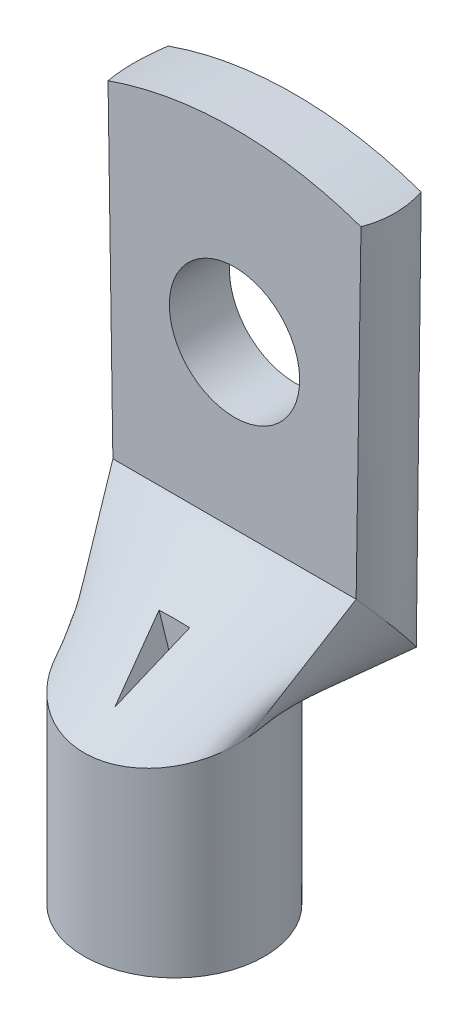
ISO-10303-21;
HEADER;
FILE_DESCRIPTION(('STEP AP214'),'2;1');
FILE_NAME('part.step','',(''),(''),'','','');
FILE_SCHEMA(('AUTOMOTIVE_DESIGN { 1 0 10303 214 1 1 1 1 }'));
ENDSEC;
DATA;
#1=APPLICATION_CONTEXT('core data for automotive mechanical design processes');
#2=APPLICATION_PROTOCOL_DEFINITION('international standard','automotive_design',2000,#1);
#3=PRODUCT_CONTEXT('',#1,'mechanical');
#4=PRODUCT('Part','Part','',(#3));
#5=PRODUCT_RELATED_PRODUCT_CATEGORY('part','',(#4));
#6=PRODUCT_DEFINITION_FORMATION('','',#4);
#7=PRODUCT_DEFINITION_CONTEXT('part definition',#1,'design');
#8=PRODUCT_DEFINITION('design','',#6,#7);
#9=PRODUCT_DEFINITION_SHAPE('','',#8);
#10=(LENGTH_UNIT() NAMED_UNIT(*) SI_UNIT(.MILLI.,.METRE.));
#11=(NAMED_UNIT(*) PLANE_ANGLE_UNIT() SI_UNIT($,.RADIAN.));
#12=(NAMED_UNIT(*) SI_UNIT($,.STERADIAN.) SOLID_ANGLE_UNIT());
#13=UNCERTAINTY_MEASURE_WITH_UNIT(LENGTH_MEASURE(1.E-05),#10,'distance_accuracy_value','');
#14=(GEOMETRIC_REPRESENTATION_CONTEXT(3) GLOBAL_UNCERTAINTY_ASSIGNED_CONTEXT((#13)) GLOBAL_UNIT_ASSIGNED_CONTEXT((#10,
#11,#12)) REPRESENTATION_CONTEXT('',''));
#15=CARTESIAN_POINT('',(0.,0.,0.));
#16=DIRECTION('',(0.,0.,1.));
#17=DIRECTION('',(1.,0.,0.));
#18=AXIS2_PLACEMENT_3D('',#15,#16,#17);
#19=CARTESIAN_POINT('',(-4.43759327224385,9.79988554904233,0.746837298302707));
#20=CARTESIAN_POINT('',(-6.06666115690584,14.7117047316475,-3.00000000000004));
#21=CARTESIAN_POINT('',(-3.33170735301633,8.03918996045832,7.31784269156063));
#22=CARTESIAN_POINT('',(-2.02222038563521,14.7117047316475,-3.00000000000001));
#23=CARTESIAN_POINT('',(3.33170735301618,8.03918996045832,7.31784269156069));
#24=CARTESIAN_POINT('',(2.02222038563542,14.7117047316475,-2.99999999999997));
#25=CARTESIAN_POINT('',(4.43759327224384,9.79988554904233,0.746837298302797));
#26=CARTESIAN_POINT('',(6.06666115690606,14.7117047316475,-2.99999999999994));
#27=(BOUNDED_SURFACE() B_SPLINE_SURFACE(3,1,((#19,#20),(#21,#22),(#23,#24),(#25,#26)),
.UNSPECIFIED.,.F.,.F.,.F.) B_SPLINE_SURFACE_WITH_KNOTS((4,4),(2,2),(0.,1.),(0.,1.),
.UNSPECIFIED.) GEOMETRIC_REPRESENTATION_ITEM() RATIONAL_B_SPLINE_SURFACE(((1.,1.),
(0.443975896044852,1.),(0.443975896044852,1.),(1.,1.))) REPRESENTATION_ITEM('') SURFACE());
#28=DIRECTION('',(0.254982294741429,-0.768799715670237,0.586456329622043));
#29=VECTOR('',#28,1.);
#30=CARTESIAN_POINT('',(-5.25212721457485,12.2557951403449,-1.12658135084867));
#31=LINE('',#30,#29);
#32=CARTESIAN_POINT('',(-6.06666115690584,14.7117047316475,-3.00000000000004));
#33=VERTEX_POINT('',#32);
#34=CARTESIAN_POINT('',(-4.43759327224385,9.79988554904233,0.746837298302707));
#35=VERTEX_POINT('',#34);
#36=EDGE_CURVE('E418',#33,#35,#31,.T.);
#37=CARTESIAN_POINT('',(0.,10.,0.));
#38=DIRECTION('',(0.,0.965925826289068,0.258819045102521));
#39=DIRECTION('',(0.,-0.258819045102521,0.965925826289068));
#40=AXIS2_PLACEMENT_3D('',#37,#38,#39);
#41=ELLIPSE('',#40,4.65874281184537,4.5);
#42=CARTESIAN_POINT('',(4.43759327224384,9.79988554904233,0.746837298302797));
#43=VERTEX_POINT('',#42);
#44=EDGE_CURVE('E374',#35,#43,#41,.T.);
#45=DIRECTION('',(0.254982294741466,0.768799715670226,-0.586456329622041));
#46=VECTOR('',#45,1.);
#47=CARTESIAN_POINT('',(5.25212721457495,12.2557951403449,-1.12658135084857));
#48=LINE('',#47,#46);
#49=CARTESIAN_POINT('',(6.06666115690606,14.7117047316475,-2.99999999999994));
#50=VERTEX_POINT('',#49);
#51=EDGE_CURVE('E419',#43,#50,#48,.T.);
#52=DIRECTION('',(1.,0.,0.));
#53=VECTOR('',#52,1.);
#54=CARTESIAN_POINT('',(6.06666115690606,14.7117047316475,-2.99999999999994));
#55=LINE('',#54,#53);
#56=EDGE_CURVE('E407',#33,#50,#55,.T.);
#57=CARTESIAN_POINT('',(0.762094838407086,12.327128956251,0.));
#58=CARTESIAN_POINT('',(0.698647976603602,12.1333879389325,0.247809321301429));
#59=CARTESIAN_POINT('',(0.635247891074762,11.9397897574104,0.495742161033394));
#60=CARTESIAN_POINT('',(0.508445440101529,11.5525864324277,0.99160124337673));
#61=CARTESIAN_POINT('',(0.445043074660415,11.358981288977,1.23952748599676));
#62=CARTESIAN_POINT('',(0.318140016954878,10.9714707517838,1.73512058115947));
#63=CARTESIAN_POINT('',(0.254639324629616,10.7775653578554,1.98278743354149));
#64=CARTESIAN_POINT('',(0.127466493393599,10.3892310415696,2.47766669423751));
#65=CARTESIAN_POINT('',(0.0637943542455803,10.1948021184877,2.7248791019218));
#66=CARTESIAN_POINT('',(0.,10.,2.97176649378657));
#67=B_SPLINE_CURVE_WITH_KNOTS('',3,(#57,#58,#59,#60,#61,#62,#63,#64,#65,#66),.UNSPECIFIED.,.F.,
.F.,(4,2,2,2,4),(0.,0.962670597872734,1.92533986282174,2.88800972365266,3.85068091740648),.UNSPECIFIED.);
#68=CARTESIAN_POINT('',(0.762094838407082,12.327128956251,0.));
#69=VERTEX_POINT('',#68);
#70=CARTESIAN_POINT('',(0.,10.,2.97176649378657));
#71=VERTEX_POINT('',#70);
#72=EDGE_CURVE('E52',#69,#71,#67,.T.);
#73=CARTESIAN_POINT('',(0.,10.,2.97176649378657));
#74=CARTESIAN_POINT('',(-0.0637943542455787,10.1948021184877,2.7248791019218));
#75=CARTESIAN_POINT('',(-0.127466493393598,10.3892310415696,2.47766669423751));
#76=CARTESIAN_POINT('',(-0.254639324629614,10.7775653578554,1.98278743354149));
#77=CARTESIAN_POINT('',(-0.318140016954876,10.9714707517838,1.73512058115947));
#78=CARTESIAN_POINT('',(-0.445043074660413,11.358981288977,1.23952748599676));
#79=CARTESIAN_POINT('',(-0.508445440101526,11.5525864324277,0.991601243376732));
#80=CARTESIAN_POINT('',(-0.635247891074758,11.9397897574104,0.495742161033398));
#81=CARTESIAN_POINT('',(-0.698647976603599,12.1333879389325,0.247809321301433));
#82=CARTESIAN_POINT('',(-0.762094838407082,12.3271289562509,0.));
#83=B_SPLINE_CURVE_WITH_KNOTS('',3,(#73,#74,#75,#76,#77,#78,#79,#80,#81,#82),.UNSPECIFIED.,.F.,
.F.,(4,2,2,2,4),(0.,0.962671193753813,1.92534105458473,2.88801031953374,3.85068091740647),.UNSPECIFIED.);
#84=CARTESIAN_POINT('',(-0.762094838407081,12.3271289562509,0.));
#85=VERTEX_POINT('',#84);
#86=EDGE_CURVE('E11',#71,#85,#83,.T.);
#87=CARTESIAN_POINT('',(1.7985556812807,12.2427436344773,0.));
#88=CARTESIAN_POINT('',(1.67884926137004,12.2569977738219,0.));
#89=CARTESIAN_POINT('',(1.55895146166107,12.2695834558094,0.));
#90=CARTESIAN_POINT('',(1.31913283137255,12.2916320330435,0.));
#91=CARTESIAN_POINT('',(1.19921262633164,12.3011017071621,0.));
#92=CARTESIAN_POINT('',(0.959367588773475,12.3171804080283,0.));
#93=CARTESIAN_POINT('',(0.839443044803351,12.3237937950793,0.));
#94=CARTESIAN_POINT('',(0.599595523632594,12.3343127070931,0.));
#95=CARTESIAN_POINT('',(0.479672663906761,12.3382209233006,0.));
#96=CARTESIAN_POINT('',(0.239833183274164,12.34342103539,0.));
#97=CARTESIAN_POINT('',(0.119916591637082,12.3447142926125,0.));
#98=CARTESIAN_POINT('',(-0.119916591637084,12.3447142926125,0.));
#99=CARTESIAN_POINT('',(-0.239833183274166,12.34342103539,0.));
#100=CARTESIAN_POINT('',(-0.479672663906763,12.3382209233006,0.));
#101=CARTESIAN_POINT('',(-0.599595523632596,12.3343127070931,0.));
#102=CARTESIAN_POINT('',(-0.839443044803353,12.3237937950793,0.));
#103=CARTESIAN_POINT('',(-0.959367588773477,12.3171804080283,0.));
#104=CARTESIAN_POINT('',(-1.19921262633165,12.301101707162,0.));
#105=CARTESIAN_POINT('',(-1.31913283137255,12.2916320330435,0.));
#106=CARTESIAN_POINT('',(-1.55895146166107,12.2695834558094,0.));
#107=CARTESIAN_POINT('',(-1.67884926137004,12.2569977738219,0.));
#108=CARTESIAN_POINT('',(-1.7985556812807,12.2427436344773,0.));
#109=B_SPLINE_CURVE_WITH_KNOTS('',3,(#87,#88,#89,#90,#91,#92,#93,#94,#95,#96,#97,#98,#99,#100,
#101,#102,#103,#104,#105,#106,#107,#108),.UNSPECIFIED.,.F.,.F.,(4,2,2,2,2,2,2,2,2,2,4),(0.,
0.361633961413975,0.722475905399559,1.08276503734737,1.44269521774399,1.80243797117901,
2.16218072461404,2.52211090501066,2.88240003695847,3.24324198094405,3.60487594235803),.UNSPECIFIED.);
#110=EDGE_CURVE('E119',#69,#85,#109,.T.);
#111=ORIENTED_EDGE('',*,*,#36,.T.);
#112=ORIENTED_EDGE('',*,*,#44,.T.);
#113=ORIENTED_EDGE('',*,*,#51,.T.);
#114=ORIENTED_EDGE('',*,*,#56,.F.);
#115=EDGE_LOOP('',(#111,#112,#113,#114));
#116=FACE_BOUND('',#115,.T.);
#117=ORIENTED_EDGE('',*,*,#72,.T.);
#118=ORIENTED_EDGE('',*,*,#86,.T.);
#119=ORIENTED_EDGE('',*,*,#110,.F.);
#120=EDGE_LOOP('',(#117,#118,#119));
#121=FACE_BOUND('',#120,.T.);
#122=ADVANCED_FACE('F38',(#116,#121),#27,.T.);
#123=CARTESIAN_POINT('',(0.,22.9524182987988,0.));
#124=DIRECTION('',(0.,-1.,0.));
#125=DIRECTION('',(0.,0.,-1.));
#126=AXIS2_PLACEMENT_3D('',#123,#124,#125);
#127=CYLINDRICAL_SURFACE('',#126,4.5);
#128=CARTESIAN_POINT('',(0.,0.,0.));
#129=DIRECTION('',(0.,1.,0.));
#130=DIRECTION('',(0.,0.,1.));
#131=AXIS2_PLACEMENT_3D('',#128,#129,#130);
#132=CIRCLE('',#131,4.5);
#133=CARTESIAN_POINT('',(0.,0.,4.5));
#134=VERTEX_POINT('',#133);
#135=EDGE_CURVE('E368',#134,#134,#132,.T.);
#136=ORIENTED_EDGE('',*,*,#135,.T.);
#137=EDGE_LOOP('',(#136));
#138=FACE_BOUND('',#137,.T.);
#139=ORIENTED_EDGE('',*,*,#44,.F.);
#140=CARTESIAN_POINT('',(-4.43759327224384,10.2001144509577,-0.746837298302797));
#141=VERTEX_POINT('',#140);
#142=EDGE_CURVE('E369',#141,#35,#41,.T.);
#143=ORIENTED_EDGE('',*,*,#142,.F.);
#144=CARTESIAN_POINT('',(0.,10.,0.));
#145=DIRECTION('',(0.,0.965925826289068,0.258819045102521));
#146=DIRECTION('',(0.,-0.258819045102521,0.965925826289068));
#147=AXIS2_PLACEMENT_3D('',#144,#145,#146);
#148=ELLIPSE('',#147,4.65874281184537,4.5);
#149=CARTESIAN_POINT('',(4.43759327224385,10.2001144509577,-0.746837298302709));
#150=VERTEX_POINT('',#149);
#151=EDGE_CURVE('E422',#150,#141,#148,.T.);
#152=ORIENTED_EDGE('',*,*,#151,.F.);
#153=EDGE_CURVE('E372',#43,#150,#41,.T.);
#154=ORIENTED_EDGE('',*,*,#153,.F.);
#155=EDGE_LOOP('',(#139,#143,#152,#154));
#156=FACE_BOUND('',#155,.T.);
#157=ADVANCED_FACE('F40',(#138,#156),#127,.T.);
#158=CARTESIAN_POINT('',(0.,0.,0.));
#159=DIRECTION('',(0.,1.,0.));
#160=DIRECTION('',(0.,0.,1.));
#161=AXIS2_PLACEMENT_3D('',#158,#159,#160);
#162=PLANE('',#161);
#163=CARTESIAN_POINT('',(0.,0.,0.));
#164=DIRECTION('',(0.,-1.,0.));
#165=DIRECTION('',(0.,0.,-1.));
#166=AXIS2_PLACEMENT_3D('',#163,#164,#165);
#167=CIRCLE('',#166,3.);
#168=CARTESIAN_POINT('',(0.,0.,-3.));
#169=VERTEX_POINT('',#168);
#170=EDGE_CURVE('E365',#169,#169,#167,.T.);
#171=ORIENTED_EDGE('',*,*,#170,.F.);
#172=EDGE_LOOP('',(#171));
#173=FACE_BOUND('',#172,.T.);
#174=ORIENTED_EDGE('',*,*,#135,.F.);
#175=EDGE_LOOP('',(#174));
#176=FACE_BOUND('',#175,.T.);
#177=ADVANCED_FACE('F175',(#173,#176),#162,.F.);
#178=CARTESIAN_POINT('',(0.,0.,0.));
#179=DIRECTION('',(0.,-1.,0.));
#180=DIRECTION('',(0.,0.,-1.));
#181=AXIS2_PLACEMENT_3D('',#178,#179,#180);
#182=CYLINDRICAL_SURFACE('',#181,3.);
#183=CARTESIAN_POINT('',(0.,8.79422863405994,0.));
#184=DIRECTION('',(0.,-1.,0.));
#185=DIRECTION('',(0.,0.,-1.));
#186=AXIS2_PLACEMENT_3D('',#183,#184,#185);
#187=CIRCLE('',#186,3.);
#188=CARTESIAN_POINT('',(0.,8.79422863405994,-3.));
#189=VERTEX_POINT('',#188);
#190=EDGE_CURVE('E375',#189,#189,#187,.T.);
#191=ORIENTED_EDGE('',*,*,#190,.F.);
#192=EDGE_LOOP('',(#191));
#193=FACE_BOUND('',#192,.T.);
#194=ORIENTED_EDGE('',*,*,#170,.T.);
#195=EDGE_LOOP('',(#194));
#196=FACE_BOUND('',#195,.T.);
#197=ADVANCED_FACE('F297',(#193,#196),#182,.F.);
#198=CARTESIAN_POINT('',(3.,8.79422863405994,0.));
#199=DIRECTION('',(0.,1.,0.));
#200=DIRECTION('',(0.,0.,1.));
#201=AXIS2_PLACEMENT_3D('',#198,#199,#200);
#202=PLANE('',#201);
#203=ORIENTED_EDGE('',*,*,#190,.T.);
#204=EDGE_LOOP('',(#203));
#205=FACE_BOUND('',#204,.T.);
#206=ADVANCED_FACE('F167',(#205),#202,.F.);
#207=CARTESIAN_POINT('',(4.43759327224384,9.79988554904233,0.746837298302797));
#208=CARTESIAN_POINT('',(6.06666115690606,14.7117047316475,-2.99999999999994));
#209=CARTESIAN_POINT('',(4.52099636322593,9.93267271254018,0.251268857535902));
#210=CARTESIAN_POINT('',(6.65116480210421,13.5476667076658,-3.97674387659929));
#211=CARTESIAN_POINT('',(4.52099636322594,10.0673272874598,-0.251268857535811));
#212=CARTESIAN_POINT('',(6.65116480210422,12.3004819778465,-5.02325612340058));
#213=CARTESIAN_POINT('',(4.43759327224385,10.2001144509577,-0.746837298302708));
#214=CARTESIAN_POINT('',(6.06666115690607,11.1364439538649,-5.99999999999994));
#215=(BOUNDED_SURFACE() B_SPLINE_SURFACE(3,1,((#207,#208),(#209,#210),(#211,#212),(#213,#214)),
.UNSPECIFIED.,.F.,.F.,.F.) B_SPLINE_SURFACE_WITH_KNOTS((4,4),(2,2),(0.,1.),(0.,1.),
.UNSPECIFIED.) GEOMETRIC_REPRESENTATION_ITEM() RATIONAL_B_SPLINE_SURFACE(((1.,1.),
(0.99075455885094,0.9555549904519),(0.99075455885094,0.9555549904519),(1.,1.))) REPRESENTATION_ITEM('') SURFACE());
#216=DIRECTION('',(0.291995042549563,0.167828225954189,-0.94157983288702));
#217=VECTOR('',#216,1.);
#218=CARTESIAN_POINT('',(5.25212721457496,10.6682792024113,-3.37341864915133));
#219=LINE('',#218,#217);
#220=CARTESIAN_POINT('',(6.06666115690607,11.1364439538649,-5.99999999999994));
#221=VERTEX_POINT('',#220);
#222=EDGE_CURVE('E415',#150,#221,#219,.T.);
#223=CARTESIAN_POINT('',(0.,12.9240743427562,-4.5));
#224=DIRECTION('',(0.,0.642787609686544,-0.766044443118974));
#225=DIRECTION('',(0.,0.766044443118974,0.642787609686544));
#226=AXIS2_PLACEMENT_3D('',#223,#224,#225);
#227=CIRCLE('',#226,6.50000000000003);
#228=EDGE_CURVE('E403',#50,#221,#227,.T.);
#229=ORIENTED_EDGE('',*,*,#51,.F.);
#230=ORIENTED_EDGE('',*,*,#153,.T.);
#231=ORIENTED_EDGE('',*,*,#222,.T.);
#232=ORIENTED_EDGE('',*,*,#228,.F.);
#233=EDGE_LOOP('',(#229,#230,#231,#232));
#234=FACE_BOUND('',#233,.T.);
#235=ADVANCED_FACE('F157',(#234),#215,.T.);
#236=CARTESIAN_POINT('',(-4.43759327224384,10.2001144509577,-0.746837298302797));
#237=CARTESIAN_POINT('',(-6.06666115690584,11.1364439538649,-6.00000000000005));
#238=CARTESIAN_POINT('',(-4.52099636322593,10.0673272874598,-0.251268857535902));
#239=CARTESIAN_POINT('',(-6.65116480210401,12.3004819778466,-5.02325612340069));
#240=CARTESIAN_POINT('',(-4.52099636322594,9.93267271254017,0.251268857535811));
#241=CARTESIAN_POINT('',(-6.65116480210401,13.5476667076659,-3.9767438765994));
#242=CARTESIAN_POINT('',(-4.43759327224385,9.79988554904233,0.746837298302707));
#243=CARTESIAN_POINT('',(-6.06666115690584,14.7117047316475,-3.00000000000004));
#244=(BOUNDED_SURFACE() B_SPLINE_SURFACE(3,1,((#236,#237),(#238,#239),(#240,#241),(#242,#243)),
.UNSPECIFIED.,.F.,.F.,.F.) B_SPLINE_SURFACE_WITH_KNOTS((4,4),(2,2),(0.,1.),(0.,1.),
.UNSPECIFIED.) GEOMETRIC_REPRESENTATION_ITEM() RATIONAL_B_SPLINE_SURFACE(((1.,1.),
(0.99075455885094,0.955554990451897),(0.99075455885094,0.955554990451897),(1.,1.))) REPRESENTATION_ITEM('') SURFACE());
#245=DIRECTION('',(0.291995042549526,-0.167828225954203,0.941579832887029));
#246=VECTOR('',#245,1.);
#247=CARTESIAN_POINT('',(-5.25212721457484,10.6682792024113,-3.37341864915142));
#248=LINE('',#247,#246);
#249=CARTESIAN_POINT('',(-6.06666115690584,11.136443953865,-6.00000000000005));
#250=VERTEX_POINT('',#249);
#251=EDGE_CURVE('E409',#250,#141,#248,.T.);
#252=CARTESIAN_POINT('',(0.,12.9240743427562,-4.5));
#253=DIRECTION('',(0.,0.642787609686544,-0.766044443118974));
#254=DIRECTION('',(0.,-0.766044443118974,-0.642787609686544));
#255=AXIS2_PLACEMENT_3D('',#252,#253,#254);
#256=CIRCLE('',#255,6.49999999999982);
#257=EDGE_CURVE('E392',#250,#33,#256,.T.);
#258=ORIENTED_EDGE('',*,*,#251,.T.);
#259=ORIENTED_EDGE('',*,*,#142,.T.);
#260=ORIENTED_EDGE('',*,*,#36,.F.);
#261=ORIENTED_EDGE('',*,*,#257,.F.);
#262=EDGE_LOOP('',(#258,#259,#260,#261));
#263=FACE_BOUND('',#262,.T.);
#264=ADVANCED_FACE('F166',(#263),#244,.T.);
#265=CARTESIAN_POINT('',(4.43759327224385,10.2001144509577,-0.746837298302708));
#266=CARTESIAN_POINT('',(6.06666115690607,11.1364439538649,-5.99999999999994));
#267=CARTESIAN_POINT('',(3.33170735301633,11.9608100395417,-7.31784269156063));
#268=CARTESIAN_POINT('',(2.02222038563543,11.1364439538649,-5.99999999999998));
#269=CARTESIAN_POINT('',(-3.33170735301618,11.9608100395417,-7.31784269156069));
#270=CARTESIAN_POINT('',(-2.0222203856352,11.1364439538649,-6.00000000000001));
#271=CARTESIAN_POINT('',(-4.43759327224384,10.2001144509577,-0.746837298302797));
#272=CARTESIAN_POINT('',(-6.06666115690584,11.1364439538649,-6.00000000000005));
#273=(BOUNDED_SURFACE() B_SPLINE_SURFACE(3,1,((#265,#266),(#267,#268),(#269,#270),(#271,#272)),
.UNSPECIFIED.,.F.,.F.,.F.) B_SPLINE_SURFACE_WITH_KNOTS((4,4),(2,2),(0.,1.),(0.,1.),
.UNSPECIFIED.) GEOMETRIC_REPRESENTATION_ITEM() RATIONAL_B_SPLINE_SURFACE(((1.,1.),
(0.443975896044852,1.),(0.443975896044852,1.),(1.,1.))) REPRESENTATION_ITEM('') SURFACE());
#274=DIRECTION('',(-1.,0.,0.));
#275=VECTOR('',#274,1.);
#276=CARTESIAN_POINT('',(-6.06666115690584,11.1364439538649,-6.00000000000005));
#277=LINE('',#276,#275);
#278=EDGE_CURVE('E406',#221,#250,#277,.T.);
#279=ORIENTED_EDGE('',*,*,#151,.T.);
#280=ORIENTED_EDGE('',*,*,#251,.F.);
#281=ORIENTED_EDGE('',*,*,#278,.F.);
#282=ORIENTED_EDGE('',*,*,#222,.F.);
#283=EDGE_LOOP('',(#279,#280,#281,#282));
#284=FACE_BOUND('',#283,.T.);
#285=ADVANCED_FACE('F260',(#284),#273,.T.);
#286=CARTESIAN_POINT('',(-6.32455532033676,32.,-5.99999999999999));
#287=DIRECTION('',(0.,0.,1.));
#288=DIRECTION('',(0.,-1.,0.));
#289=AXIS2_PLACEMENT_3D('',#286,#287,#288);
#290=PLANE('',#289);
#291=CARTESIAN_POINT('',(0.,22.7827896785213,-6.00000000000002));
#292=DIRECTION('',(0.,0.,1.));
#293=DIRECTION('',(0.,-1.,0.));
#294=AXIS2_PLACEMENT_3D('',#291,#292,#293);
#295=CIRCLE('',#294,3.25);
#296=CARTESIAN_POINT('',(0.,19.5327896785213,-6.00000000000003));
#297=VERTEX_POINT('',#296);
#298=EDGE_CURVE('E382',#297,#297,#295,.T.);
#299=ORIENTED_EDGE('',*,*,#298,.T.);
#300=EDGE_LOOP('',(#299));
#301=FACE_BOUND('',#300,.T.);
#302=DIRECTION('',(-0.012360043646205,0.999923611742949,0.));
#303=VECTOR('',#302,1.);
#304=CARTESIAN_POINT('',(-6.06666115690584,11.136443953865,-6.00000000000005));
#305=LINE('',#304,#303);
#306=CARTESIAN_POINT('',(-6.31122347622092,30.921458038411,-6.));
#307=VERTEX_POINT('',#306);
#308=EDGE_CURVE('E395',#250,#307,#305,.T.);
#309=ORIENTED_EDGE('',*,*,#308,.T.);
#310=CARTESIAN_POINT('',(0.,12.9952713989393,-6.00000000000004));
#311=DIRECTION('',(0.,0.,1.));
#312=DIRECTION('',(0.,-1.,0.));
#313=AXIS2_PLACEMENT_3D('',#310,#311,#312);
#314=CIRCLE('',#313,19.0047286010607);
#315=CARTESIAN_POINT('',(6.31122347622093,30.921458038411,-5.99999999999999));
#316=VERTEX_POINT('',#315);
#317=EDGE_CURVE('E383',#307,#316,#314,.F.);
#318=ORIENTED_EDGE('',*,*,#317,.T.);
#319=DIRECTION('',(0.0123600436461939,0.999923611742949,0.));
#320=VECTOR('',#319,1.);
#321=CARTESIAN_POINT('',(6.06666115690607,11.1364439538649,-5.99999999999994));
#322=LINE('',#321,#320);
#323=EDGE_CURVE('E400',#221,#316,#322,.T.);
#324=ORIENTED_EDGE('',*,*,#323,.F.);
#325=ORIENTED_EDGE('',*,*,#278,.T.);
#326=EDGE_LOOP('',(#309,#318,#324,#325));
#327=FACE_BOUND('',#326,.T.);
#328=ADVANCED_FACE('F154',(#301,#327),#290,.F.);
#329=CARTESIAN_POINT('',(6.06666115690606,14.7117047316475,-2.99999999999994));
#330=CARTESIAN_POINT('',(6.32455532033676,32.,-3.));
#331=CARTESIAN_POINT('',(6.65116480210421,13.5476667076658,-3.97674387659929));
#332=CARTESIAN_POINT('',(6.559553179216,32.,-3.9908379724283));
#333=CARTESIAN_POINT('',(6.65116480210422,12.3004819778465,-5.02325612340058));
#334=CARTESIAN_POINT('',(6.559553179216,32.,-5.00916202757169));
#335=CARTESIAN_POINT('',(6.06666115690607,11.1364439538649,-5.99999999999994));
#336=CARTESIAN_POINT('',(6.32455532033676,32.,-5.99999999999999));
#337=(BOUNDED_SURFACE() B_SPLINE_SURFACE(3,1,((#329,#330),(#331,#332),(#333,#334),(#335,#336)),
.UNSPECIFIED.,.F.,.F.,.F.) B_SPLINE_SURFACE_WITH_KNOTS((4,4),(2,2),(0.,1.),(0.,1.),
.UNSPECIFIED.) GEOMETRIC_REPRESENTATION_ITEM() RATIONAL_B_SPLINE_SURFACE(((1.,1.),
(0.9555549904519,0.982005673880693),(0.9555549904519,0.982005673880693),(1.,1.))) REPRESENTATION_ITEM('') SURFACE());
#338=CARTESIAN_POINT('',(6.30848081958914,30.9224234022233,-2.99999999999999));
#339=CARTESIAN_POINT('',(6.33616181672725,30.9126795519794,-3.10703312737161));
#340=CARTESIAN_POINT('',(6.36094425375129,30.9038895471593,-3.21490944207242));
#341=CARTESIAN_POINT('',(6.40456774288053,30.8883367344973,-3.432017106251));
#342=CARTESIAN_POINT('',(6.42340790373262,30.8815742307579,-3.54124865644288));
#343=CARTESIAN_POINT('',(6.45499568397724,30.8701983814127,-3.7607135477046));
#344=CARTESIAN_POINT('',(6.46774272597274,30.865585239486,-3.87094698270699));
#345=CARTESIAN_POINT('',(6.48705809049002,30.858582795769,-4.09201241130531));
#346=CARTESIAN_POINT('',(6.49362704281067,30.8561932673023,-4.20284434273136));
#347=CARTESIAN_POINT('',(6.50055875641218,30.8536716436165,-4.42472642959265));
#348=CARTESIAN_POINT('',(6.50092174851006,30.8535394644402,-4.53577657675819));
#349=CARTESIAN_POINT('',(6.49547396030697,30.8555214350921,-4.75771361535138));
#350=CARTESIAN_POINT('',(6.48966204250088,30.8576359988017,-4.86860047293004));
#351=CARTESIAN_POINT('',(6.46699041807303,30.8658613207926,-5.15153096345042));
#352=CARTESIAN_POINT('',(6.44577820844089,30.8735426450663,-5.3232087110118));
#353=CARTESIAN_POINT('',(6.40324677704546,30.8887997077512,-5.5786908783151));
#354=CARTESIAN_POINT('',(6.38727526716624,30.8945110516166,-5.66354728520599));
#355=CARTESIAN_POINT('',(6.35184450272543,30.9071147275279,-5.83242518832612));
#356=CARTESIAN_POINT('',(6.33238586105359,30.9140068520334,-5.91644682853741));
#357=CARTESIAN_POINT('',(6.31122347622093,30.921458038411,-5.99999999999999));
#358=B_SPLINE_CURVE_WITH_KNOTS('',3,(#338,#339,#340,#341,#342,#343,#344,#345,#346,#347,#348,
#349,#350,#351,#352,#353,#354,#355,#356,#357),.UNSPECIFIED.,.F.,.F.,(4,2,2,2,2,2,2,2,2,4),(0.,
0.332914380507215,0.665878669505902,0.998874504664213,1.33183639030905,1.66478589214308,
1.99779673858669,2.51644225897069,2.77598032439412,3.03547281870008),.UNSPECIFIED.);
#359=CARTESIAN_POINT('',(6.30848081958914,30.9224234022233,-2.99999999999999));
#360=VERTEX_POINT('',#359);
#361=EDGE_CURVE('E131',#360,#316,#358,.T.);
#362=DIRECTION('',(-0.0149156102597124,-0.999888756097687,0.));
#363=VECTOR('',#362,1.);
#364=CARTESIAN_POINT('',(6.19560823862141,23.3558523658237,-2.99999999999997));
#365=LINE('',#364,#363);
#366=EDGE_CURVE('E389',#360,#50,#365,.T.);
#367=ORIENTED_EDGE('',*,*,#361,.F.);
#368=ORIENTED_EDGE('',*,*,#366,.T.);
#369=ORIENTED_EDGE('',*,*,#228,.T.);
#370=ORIENTED_EDGE('',*,*,#323,.T.);
#371=EDGE_LOOP('',(#367,#368,#369,#370));
#372=FACE_BOUND('',#371,.T.);
#373=ADVANCED_FACE('F161',(#372),#337,.T.);
#374=CARTESIAN_POINT('',(-6.06666115690584,11.1364439538649,-6.00000000000005));
#375=CARTESIAN_POINT('',(-6.32455532033676,32.,-5.99999999999999));
#376=CARTESIAN_POINT('',(-6.65116480210401,12.3004819778466,-5.0232561234007));
#377=CARTESIAN_POINT('',(-6.559553179216,32.,-5.00916202757169));
#378=CARTESIAN_POINT('',(-6.65116480210401,13.5476667076659,-3.9767438765994));
#379=CARTESIAN_POINT('',(-6.559553179216,32.,-3.9908379724283));
#380=CARTESIAN_POINT('',(-6.06666115690584,14.7117047316475,-3.00000000000004));
#381=CARTESIAN_POINT('',(-6.32455532033676,32.,-3.));
#382=(BOUNDED_SURFACE() B_SPLINE_SURFACE(3,1,((#374,#375),(#376,#377),(#378,#379),(#380,#381)),
.UNSPECIFIED.,.F.,.F.,.F.) B_SPLINE_SURFACE_WITH_KNOTS((4,4),(2,2),(0.,1.),(0.,1.),
.UNSPECIFIED.) GEOMETRIC_REPRESENTATION_ITEM() RATIONAL_B_SPLINE_SURFACE(((1.,1.),
(0.955554990451897,0.982005673880693),(0.955554990451897,0.982005673880693),(1.,1.))) REPRESENTATION_ITEM('') SURFACE());
#383=CARTESIAN_POINT('',(-6.31122347622092,30.921458038411,-6.));
#384=CARTESIAN_POINT('',(-6.33837180158207,30.9118983690319,-5.89280815709008));
#385=CARTESIAN_POINT('',(-6.36271536030312,30.9032605280524,-5.78485217209642));
#386=CARTESIAN_POINT('',(-6.40562605917218,30.8879567634501,-5.56763757272945));
#387=CARTESIAN_POINT('',(-6.42419197576139,30.8812912575327,-5.45837868751462));
#388=CARTESIAN_POINT('',(-6.47094573423133,30.8644554114132,-5.12913649584764));
#389=CARTESIAN_POINT('',(-6.49021001251412,30.8574384463567,-4.90760763072109));
#390=CARTESIAN_POINT('',(-6.50056455865933,30.8536684675645,-4.57481652639276));
#391=CARTESIAN_POINT('',(-6.50092381807575,30.8535384279182,-4.46377893529517));
#392=CARTESIAN_POINT('',(-6.49544476194414,30.8555323426249,-4.2418522702041));
#393=CARTESIAN_POINT('',(-6.48960548177062,30.8576566478022,-4.13096322201635));
#394=CARTESIAN_POINT('',(-6.46674691940966,30.8659494446909,-3.84804340602041));
#395=CARTESIAN_POINT('',(-6.44530990320987,30.8737122396928,-3.67638802928204));
#396=CARTESIAN_POINT('',(-6.40215548714991,30.8891903718464,-3.42100382600453));
#397=CARTESIAN_POINT('',(-6.38592614360455,30.8949927853964,-3.3361816819555));
#398=CARTESIAN_POINT('',(-6.34987710784027,30.9078126098815,-3.16740853985827));
#399=CARTESIAN_POINT('',(-6.33005791968848,30.9148298502308,-3.08345742125281));
#400=CARTESIAN_POINT('',(-6.30848081958913,30.9224234022233,-3.));
#401=B_SPLINE_CURVE_WITH_KNOTS('',3,(#383,#384,#385,#386,#387,#388,#389,#390,#391,#392,#393,
#394,#395,#396,#397,#398,#399,#400),.UNSPECIFIED.,.F.,.F.,(4,2,2,2,2,2,2,2,4),(0.,
0.332864926203195,0.66580029690191,1.33142369048861,1.66438055650056,1.99738924532709,
2.51603370888194,2.77562808171559,3.0351860318873),.UNSPECIFIED.);
#402=CARTESIAN_POINT('',(-6.30848081958913,30.9224234022233,-2.99999999999999));
#403=VERTEX_POINT('',#402);
#404=EDGE_CURVE('E67',#307,#403,#401,.T.);
#405=DIRECTION('',(-0.0149156102597253,0.999888756097687,0.));
#406=VECTOR('',#405,1.);
#407=CARTESIAN_POINT('',(-6.1956082386213,23.3558523658238,-3.00000000000002));
#408=LINE('',#407,#406);
#409=EDGE_CURVE('E388',#33,#403,#408,.T.);
#410=ORIENTED_EDGE('',*,*,#404,.F.);
#411=ORIENTED_EDGE('',*,*,#308,.F.);
#412=ORIENTED_EDGE('',*,*,#257,.T.);
#413=ORIENTED_EDGE('',*,*,#409,.T.);
#414=EDGE_LOOP('',(#410,#411,#412,#413));
#415=FACE_BOUND('',#414,.T.);
#416=ADVANCED_FACE('F138',(#415),#382,.T.);
#417=CARTESIAN_POINT('',(6.06666115690606,14.7117047316475,-2.99999999999994));
#418=DIRECTION('',(0.,0.,-1.));
#419=DIRECTION('',(-1.,0.,0.));
#420=AXIS2_PLACEMENT_3D('',#417,#418,#419);
#421=PLANE('',#420);
#422=CARTESIAN_POINT('',(0.,22.7827896785213,-3.00000000000002));
#423=DIRECTION('',(0.,0.,-1.));
#424=DIRECTION('',(-1.,0.,0.));
#425=AXIS2_PLACEMENT_3D('',#422,#423,#424);
#426=CIRCLE('',#425,3.25);
#427=CARTESIAN_POINT('',(-3.25,22.7827896785213,-3.00000000000005));
#428=VERTEX_POINT('',#427);
#429=EDGE_CURVE('E381',#428,#428,#426,.T.);
#430=ORIENTED_EDGE('',*,*,#429,.T.);
#431=EDGE_LOOP('',(#430));
#432=FACE_BOUND('',#431,.T.);
#433=ORIENTED_EDGE('',*,*,#366,.F.);
#434=CARTESIAN_POINT('',(0.,12.9952713989393,-2.99999999999998));
#435=DIRECTION('',(0.,0.,-1.));
#436=DIRECTION('',(-1.,0.,0.));
#437=AXIS2_PLACEMENT_3D('',#434,#435,#436);
#438=CIRCLE('',#437,19.0047286010607);
#439=EDGE_CURVE('E380',#360,#403,#438,.F.);
#440=ORIENTED_EDGE('',*,*,#439,.T.);
#441=ORIENTED_EDGE('',*,*,#409,.F.);
#442=ORIENTED_EDGE('',*,*,#56,.T.);
#443=EDGE_LOOP('',(#433,#440,#441,#442));
#444=FACE_BOUND('',#443,.T.);
#445=ADVANCED_FACE('F152',(#432,#444),#421,.F.);
#446=CARTESIAN_POINT('',(0.,22.7827896785213,-7.31784269156069));
#447=DIRECTION('',(0.,0.,1.));
#448=DIRECTION('',(1.,0.,0.));
#449=AXIS2_PLACEMENT_3D('',#446,#447,#448);
#450=CYLINDRICAL_SURFACE('',#449,3.25);
#451=ORIENTED_EDGE('',*,*,#429,.F.);
#452=EDGE_LOOP('',(#451));
#453=FACE_BOUND('',#452,.T.);
#454=ORIENTED_EDGE('',*,*,#298,.F.);
#455=EDGE_LOOP('',(#454));
#456=FACE_BOUND('',#455,.T.);
#457=ADVANCED_FACE('F147',(#453,#456),#450,.F.);
#458=CARTESIAN_POINT('',(0.,12.9952713989393,-7.31784269156069));
#459=DIRECTION('',(0.,0.,1.));
#460=DIRECTION('',(1.,0.,0.));
#461=AXIS2_PLACEMENT_3D('',#458,#459,#460);
#462=CYLINDRICAL_SURFACE('',#461,19.0047286010607);
#463=ORIENTED_EDGE('',*,*,#317,.F.);
#464=ORIENTED_EDGE('',*,*,#404,.T.);
#465=ORIENTED_EDGE('',*,*,#439,.F.);
#466=ORIENTED_EDGE('',*,*,#361,.T.);
#467=EDGE_LOOP('',(#463,#464,#465,#466));
#468=FACE_BOUND('',#467,.T.);
#469=ADVANCED_FACE('F143',(#468),#462,.T.);
#470=CARTESIAN_POINT('',(-1.77722893407184,15.4269373126975,7.31784269156069));
#471=DIRECTION('',(0.950338080271553,0.311219429319218,0.));
#472=DIRECTION('',(-0.311219429319218,0.950338080271553,0.));
#473=AXIS2_PLACEMENT_3D('',#470,#471,#472);
#474=PLANE('',#473);
#475=DIRECTION('',(0.,0.,-1.));
#476=VECTOR('',#475,1.);
#477=CARTESIAN_POINT('',(0.,10.,7.31784269156069));
#478=LINE('',#477,#476);
#479=CARTESIAN_POINT('',(0.,10.,0.));
#480=VERTEX_POINT('',#479);
#481=EDGE_CURVE('E111',#71,#480,#478,.T.);
#482=ORIENTED_EDGE('',*,*,#481,.T.);
#483=DIRECTION('',(0.311219429319218,-0.950338080271553,0.));
#484=VECTOR('',#483,1.);
#485=CARTESIAN_POINT('',(-1.77722893407184,15.4269373126975,0.));
#486=LINE('',#485,#484);
#487=EDGE_CURVE('E113',#85,#480,#486,.T.);
#488=ORIENTED_EDGE('',*,*,#487,.F.);
#489=ORIENTED_EDGE('',*,*,#86,.F.);
#490=EDGE_LOOP('',(#482,#488,#489));
#491=FACE_BOUND('',#490,.T.);
#492=ADVANCED_FACE('F112',(#491),#474,.T.);
#493=CARTESIAN_POINT('',(1.77722893407184,15.4269373126975,7.31784269156069));
#494=DIRECTION('',(-0.950338080271553,0.311219429319218,0.));
#495=DIRECTION('',(-0.311219429319218,-0.950338080271553,0.));
#496=AXIS2_PLACEMENT_3D('',#493,#494,#495);
#497=PLANE('',#496);
#498=DIRECTION('',(0.311219429319218,0.950338080271553,0.));
#499=VECTOR('',#498,1.);
#500=CARTESIAN_POINT('',(1.77722893407184,15.4269373126975,0.));
#501=LINE('',#500,#499);
#502=EDGE_CURVE('E59',#480,#69,#501,.T.);
#503=ORIENTED_EDGE('',*,*,#502,.F.);
#504=ORIENTED_EDGE('',*,*,#481,.F.);
#505=ORIENTED_EDGE('',*,*,#72,.F.);
#506=EDGE_LOOP('',(#503,#504,#505));
#507=FACE_BOUND('',#506,.T.);
#508=ADVANCED_FACE('F121',(#507),#497,.T.);
#509=CARTESIAN_POINT('',(1.77722893407184,15.4269373126975,0.));
#510=DIRECTION('',(0.,0.,-1.));
#511=DIRECTION('',(-1.,0.,0.));
#512=AXIS2_PLACEMENT_3D('',#509,#510,#511);
#513=PLANE('',#512);
#514=ORIENTED_EDGE('',*,*,#110,.T.);
#515=ORIENTED_EDGE('',*,*,#487,.T.);
#516=ORIENTED_EDGE('',*,*,#502,.T.);
#517=EDGE_LOOP('',(#514,#515,#516));
#518=FACE_BOUND('',#517,.T.);
#519=ADVANCED_FACE('F117',(#518),#513,.F.);
#520=CLOSED_SHELL('',(#122,#157,#177,#197,#206,#235,#264,#285,#328,#373,#416,#445,#457,#469,
#492,#508,#519));
#521=MANIFOLD_SOLID_BREP('B2',#520);
#522=ADVANCED_BREP_SHAPE_REPRESENTATION('',(#18,#521),#14);
#523=SHAPE_DEFINITION_REPRESENTATION(#9,#522);
ENDSEC;
END-ISO-10303-21;
